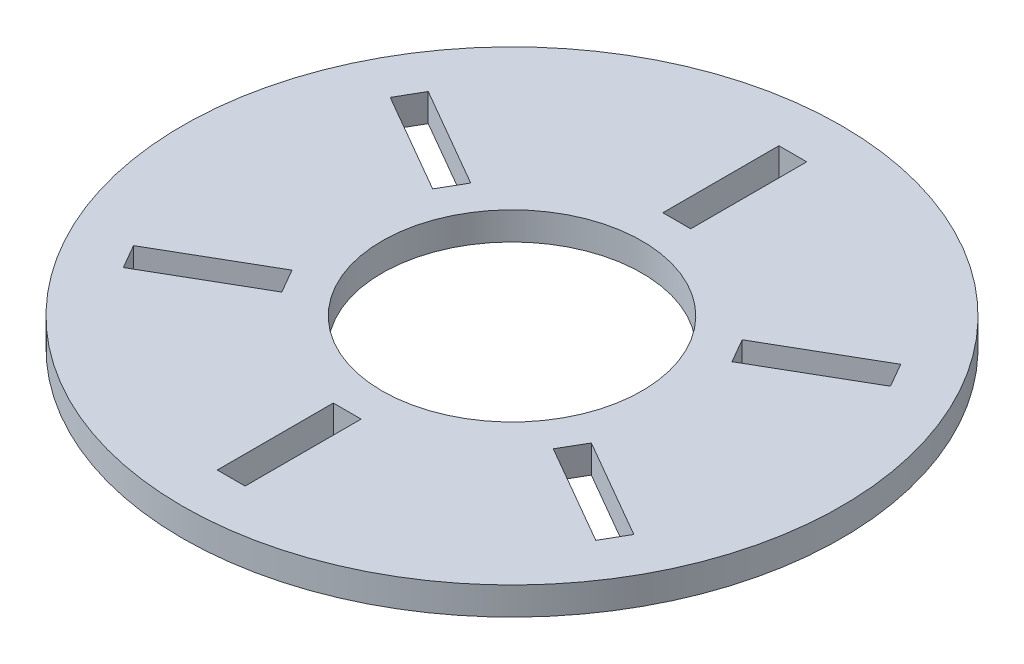
ISO-10303-21;
HEADER;
FILE_DESCRIPTION(('STEP AP214'),'2;1');
FILE_NAME('part.step','',(''),(''),'','','');
FILE_SCHEMA(('AUTOMOTIVE_DESIGN { 1 0 10303 214 1 1 1 1 }'));
ENDSEC;
DATA;
#1=APPLICATION_CONTEXT('core data for automotive mechanical design processes');
#2=APPLICATION_PROTOCOL_DEFINITION('international standard','automotive_design',2000,#1);
#3=PRODUCT_CONTEXT('',#1,'mechanical');
#4=PRODUCT('Part','Part','',(#3));
#5=PRODUCT_RELATED_PRODUCT_CATEGORY('part','',(#4));
#6=PRODUCT_DEFINITION_FORMATION('','',#4);
#7=PRODUCT_DEFINITION_CONTEXT('part definition',#1,'design');
#8=PRODUCT_DEFINITION('design','',#6,#7);
#9=PRODUCT_DEFINITION_SHAPE('','',#8);
#10=(LENGTH_UNIT() NAMED_UNIT(*) SI_UNIT(.MILLI.,.METRE.));
#11=(NAMED_UNIT(*) PLANE_ANGLE_UNIT() SI_UNIT($,.RADIAN.));
#12=(NAMED_UNIT(*) SI_UNIT($,.STERADIAN.) SOLID_ANGLE_UNIT());
#13=UNCERTAINTY_MEASURE_WITH_UNIT(LENGTH_MEASURE(1.E-05),#10,'distance_accuracy_value','');
#14=(GEOMETRIC_REPRESENTATION_CONTEXT(3) GLOBAL_UNCERTAINTY_ASSIGNED_CONTEXT((#13)) GLOBAL_UNIT_ASSIGNED_CONTEXT((#10,
#11,#12)) REPRESENTATION_CONTEXT('',''));
#15=CARTESIAN_POINT('',(0.,0.,0.));
#16=DIRECTION('',(0.,0.,1.));
#17=DIRECTION('',(1.,0.,0.));
#18=AXIS2_PLACEMENT_3D('',#15,#16,#17);
#19=CARTESIAN_POINT('',(0.,6.,0.));
#20=DIRECTION('',(0.,1.,0.));
#21=DIRECTION('',(0.,0.,1.));
#22=AXIS2_PLACEMENT_3D('',#19,#20,#21);
#23=PLANE('',#22);
#24=DIRECTION('',(0.499999999999999,0.,-0.866025403784439));
#25=VECTOR('',#24,1.);
#26=CARTESIAN_POINT('',(-30.7439018343476,6.,-17.75));
#27=LINE('',#26,#25);
#28=CARTESIAN_POINT('',(-32.2439018343476,6.,-15.1519237886467));
#29=VERTEX_POINT('',#28);
#30=CARTESIAN_POINT('',(-29.2439018343476,6.,-20.3480762113533));
#31=VERTEX_POINT('',#30);
#32=EDGE_CURVE('E229',#29,#31,#27,.T.);
#33=ORIENTED_EDGE('',*,*,#32,.F.);
#34=DIRECTION('',(0.866025403784439,0.,0.499999999999999));
#35=VECTOR('',#34,1.);
#36=CARTESIAN_POINT('',(-1.49999999999999,6.,2.5980762113533));
#37=LINE('',#36,#35);
#38=CARTESIAN_POINT('',(-53.8945369289586,6.,-27.6519237886466));
#39=VERTEX_POINT('',#38);
#40=EDGE_CURVE('E222',#39,#29,#37,.T.);
#41=ORIENTED_EDGE('',*,*,#40,.F.);
#42=DIRECTION('',(-0.499999999999999,0.,0.866025403784439));
#43=VECTOR('',#42,1.);
#44=CARTESIAN_POINT('',(-52.3945369289586,6.,-30.2499999999999));
#45=LINE('',#44,#43);
#46=CARTESIAN_POINT('',(-50.8945369289586,6.,-32.8480762113533));
#47=VERTEX_POINT('',#46);
#48=EDGE_CURVE('E202',#47,#39,#45,.T.);
#49=ORIENTED_EDGE('',*,*,#48,.F.);
#50=DIRECTION('',(-0.866025403784439,0.,-0.499999999999999));
#51=VECTOR('',#50,1.);
#52=CARTESIAN_POINT('',(1.50000000000001,6.,-2.59807621135334));
#53=LINE('',#52,#51);
#54=EDGE_CURVE('E227',#31,#47,#53,.T.);
#55=ORIENTED_EDGE('',*,*,#54,.F.);
#56=EDGE_LOOP('',(#33,#41,#49,#55));
#57=FACE_BOUND('',#56,.T.);
#58=DIRECTION('',(-0.500000000000001,0.,-0.866025403784438));
#59=VECTOR('',#58,1.);
#60=CARTESIAN_POINT('',(-30.7439018343476,6.,17.75));
#61=LINE('',#60,#59);
#62=CARTESIAN_POINT('',(-29.2439018343476,6.,20.3480762113533));
#63=VERTEX_POINT('',#62);
#64=CARTESIAN_POINT('',(-32.2439018343476,6.,15.1519237886467));
#65=VERTEX_POINT('',#64);
#66=EDGE_CURVE('E258',#63,#65,#61,.T.);
#67=ORIENTED_EDGE('',*,*,#66,.F.);
#68=DIRECTION('',(0.866025403784438,0.,-0.5));
#69=VECTOR('',#68,1.);
#70=CARTESIAN_POINT('',(1.5,6.,2.59807621135331));
#71=LINE('',#70,#69);
#72=CARTESIAN_POINT('',(-50.8945369289585,6.,32.8480762113533));
#73=VERTEX_POINT('',#72);
#74=EDGE_CURVE('E245',#73,#63,#71,.T.);
#75=ORIENTED_EDGE('',*,*,#74,.F.);
#76=DIRECTION('',(0.500000000000001,0.,0.866025403784438));
#77=VECTOR('',#76,1.);
#78=CARTESIAN_POINT('',(-52.3945369289585,6.,30.25));
#79=LINE('',#78,#77);
#80=CARTESIAN_POINT('',(-53.8945369289585,6.,27.6519237886467));
#81=VERTEX_POINT('',#80);
#82=EDGE_CURVE('E253',#81,#73,#79,.T.);
#83=ORIENTED_EDGE('',*,*,#82,.F.);
#84=DIRECTION('',(-0.866025403784438,0.,0.5));
#85=VECTOR('',#84,1.);
#86=CARTESIAN_POINT('',(-1.5,6.,-2.59807621135331));
#87=LINE('',#86,#85);
#88=EDGE_CURVE('E256',#65,#81,#87,.T.);
#89=ORIENTED_EDGE('',*,*,#88,.F.);
#90=EDGE_LOOP('',(#67,#75,#83,#89));
#91=FACE_BOUND('',#90,.T.);
#92=DIRECTION('',(-1.,0.,0.));
#93=VECTOR('',#92,1.);
#94=CARTESIAN_POINT('',(0.,6.,35.5));
#95=LINE('',#94,#93);
#96=CARTESIAN_POINT('',(3.,6.,35.5));
#97=VERTEX_POINT('',#96);
#98=CARTESIAN_POINT('',(-3.,6.,35.5));
#99=VERTEX_POINT('',#98);
#100=EDGE_CURVE('E287',#97,#99,#95,.T.);
#101=ORIENTED_EDGE('',*,*,#100,.F.);
#102=DIRECTION('',(0.,0.,-1.));
#103=VECTOR('',#102,1.);
#104=CARTESIAN_POINT('',(2.99999999999999,6.,0.));
#105=LINE('',#104,#103);
#106=CARTESIAN_POINT('',(3.,6.,60.5));
#107=VERTEX_POINT('',#106);
#108=EDGE_CURVE('E274',#107,#97,#105,.T.);
#109=ORIENTED_EDGE('',*,*,#108,.F.);
#110=DIRECTION('',(1.,0.,0.));
#111=VECTOR('',#110,1.);
#112=CARTESIAN_POINT('',(0.,6.,60.5));
#113=LINE('',#112,#111);
#114=CARTESIAN_POINT('',(-3.,6.,60.5));
#115=VERTEX_POINT('',#114);
#116=EDGE_CURVE('E282',#115,#107,#113,.T.);
#117=ORIENTED_EDGE('',*,*,#116,.F.);
#118=DIRECTION('',(0.,0.,1.));
#119=VECTOR('',#118,1.);
#120=CARTESIAN_POINT('',(-3.00000000000001,6.,0.));
#121=LINE('',#120,#119);
#122=EDGE_CURVE('E285',#99,#115,#121,.T.);
#123=ORIENTED_EDGE('',*,*,#122,.F.);
#124=EDGE_LOOP('',(#101,#109,#117,#123));
#125=FACE_BOUND('',#124,.T.);
#126=DIRECTION('',(-0.5,0.,0.866025403784438));
#127=VECTOR('',#126,1.);
#128=CARTESIAN_POINT('',(30.7439018343476,6.,17.75));
#129=LINE('',#128,#127);
#130=CARTESIAN_POINT('',(32.2439018343476,6.,15.1519237886467));
#131=VERTEX_POINT('',#130);
#132=CARTESIAN_POINT('',(29.2439018343476,6.,20.3480762113533));
#133=VERTEX_POINT('',#132);
#134=EDGE_CURVE('E316',#131,#133,#129,.T.);
#135=ORIENTED_EDGE('',*,*,#134,.F.);
#136=DIRECTION('',(-0.866025403784439,0.,-0.5));
#137=VECTOR('',#136,1.);
#138=CARTESIAN_POINT('',(1.5,6.,-2.59807621135331));
#139=LINE('',#138,#137);
#140=CARTESIAN_POINT('',(53.8945369289586,6.,27.6519237886467));
#141=VERTEX_POINT('',#140);
#142=EDGE_CURVE('E303',#141,#131,#139,.T.);
#143=ORIENTED_EDGE('',*,*,#142,.F.);
#144=DIRECTION('',(0.500000000000001,0.,-0.866025403784438));
#145=VECTOR('',#144,1.);
#146=CARTESIAN_POINT('',(52.3945369289585,6.,30.2500000000001));
#147=LINE('',#146,#145);
#148=CARTESIAN_POINT('',(50.8945369289585,6.,32.8480762113533));
#149=VERTEX_POINT('',#148);
#150=EDGE_CURVE('E311',#149,#141,#147,.T.);
#151=ORIENTED_EDGE('',*,*,#150,.F.);
#152=DIRECTION('',(0.866025403784439,0.,0.5));
#153=VECTOR('',#152,1.);
#154=CARTESIAN_POINT('',(-1.5,6.,2.59807621135332));
#155=LINE('',#154,#153);
#156=EDGE_CURVE('E314',#133,#149,#155,.T.);
#157=ORIENTED_EDGE('',*,*,#156,.F.);
#158=EDGE_LOOP('',(#135,#143,#151,#157));
#159=FACE_BOUND('',#158,.T.);
#160=DIRECTION('',(0.500000000000001,0.,0.866025403784438));
#161=VECTOR('',#160,1.);
#162=CARTESIAN_POINT('',(30.7439018343476,6.,-17.75));
#163=LINE('',#162,#161);
#164=CARTESIAN_POINT('',(29.2439018343476,6.,-20.3480762113533));
#165=VERTEX_POINT('',#164);
#166=CARTESIAN_POINT('',(32.2439018343476,6.,-15.1519237886467));
#167=VERTEX_POINT('',#166);
#168=EDGE_CURVE('E345',#165,#167,#163,.T.);
#169=ORIENTED_EDGE('',*,*,#168,.F.);
#170=DIRECTION('',(-0.866025403784439,0.,0.5));
#171=VECTOR('',#170,1.);
#172=CARTESIAN_POINT('',(-1.5,6.,-2.59807621135331));
#173=LINE('',#172,#171);
#174=CARTESIAN_POINT('',(50.8945369289585,6.,-32.8480762113533));
#175=VERTEX_POINT('',#174);
#176=EDGE_CURVE('E332',#175,#165,#173,.T.);
#177=ORIENTED_EDGE('',*,*,#176,.F.);
#178=DIRECTION('',(-0.500000000000001,0.,-0.866025403784438));
#179=VECTOR('',#178,1.);
#180=CARTESIAN_POINT('',(52.3945369289585,6.,-30.2500000000001));
#181=LINE('',#180,#179);
#182=CARTESIAN_POINT('',(53.8945369289585,6.,-27.6519237886467));
#183=VERTEX_POINT('',#182);
#184=EDGE_CURVE('E340',#183,#175,#181,.T.);
#185=ORIENTED_EDGE('',*,*,#184,.F.);
#186=DIRECTION('',(0.866025403784439,0.,-0.5));
#187=VECTOR('',#186,1.);
#188=CARTESIAN_POINT('',(1.50000000000001,6.,2.59807621135333));
#189=LINE('',#188,#187);
#190=EDGE_CURVE('E343',#167,#183,#189,.T.);
#191=ORIENTED_EDGE('',*,*,#190,.F.);
#192=EDGE_LOOP('',(#169,#177,#185,#191));
#193=FACE_BOUND('',#192,.T.);
#194=DIRECTION('',(0.,0.,1.));
#195=VECTOR('',#194,1.);
#196=CARTESIAN_POINT('',(-2.99999999999999,6.,0.));
#197=LINE('',#196,#195);
#198=CARTESIAN_POINT('',(-2.99999999999999,6.,-60.5));
#199=VERTEX_POINT('',#198);
#200=CARTESIAN_POINT('',(-2.99999999999999,6.,-35.5));
#201=VERTEX_POINT('',#200);
#202=EDGE_CURVE('E374',#199,#201,#197,.T.);
#203=ORIENTED_EDGE('',*,*,#202,.F.);
#204=DIRECTION('',(-1.,0.,0.));
#205=VECTOR('',#204,1.);
#206=CARTESIAN_POINT('',(0.,6.,-60.5));
#207=LINE('',#206,#205);
#208=CARTESIAN_POINT('',(3.00000000000001,6.,-60.5));
#209=VERTEX_POINT('',#208);
#210=EDGE_CURVE('E361',#209,#199,#207,.T.);
#211=ORIENTED_EDGE('',*,*,#210,.F.);
#212=DIRECTION('',(0.,0.,-1.));
#213=VECTOR('',#212,1.);
#214=CARTESIAN_POINT('',(3.00000000000001,6.,0.));
#215=LINE('',#214,#213);
#216=CARTESIAN_POINT('',(3.00000000000001,6.,-35.5));
#217=VERTEX_POINT('',#216);
#218=EDGE_CURVE('E369',#217,#209,#215,.T.);
#219=ORIENTED_EDGE('',*,*,#218,.F.);
#220=DIRECTION('',(1.,0.,0.));
#221=VECTOR('',#220,1.);
#222=CARTESIAN_POINT('',(0.,6.,-35.5));
#223=LINE('',#222,#221);
#224=EDGE_CURVE('E372',#201,#217,#223,.T.);
#225=ORIENTED_EDGE('',*,*,#224,.F.);
#226=EDGE_LOOP('',(#203,#211,#219,#225));
#227=FACE_BOUND('',#226,.T.);
#228=CARTESIAN_POINT('',(0.,6.,0.));
#229=DIRECTION('',(0.,1.,0.));
#230=DIRECTION('',(0.,0.,1.));
#231=AXIS2_PLACEMENT_3D('',#228,#229,#230);
#232=CIRCLE('',#231,71.);
#233=CARTESIAN_POINT('',(0.,6.,71.));
#234=VERTEX_POINT('',#233);
#235=EDGE_CURVE('E11',#234,#234,#232,.T.);
#236=ORIENTED_EDGE('',*,*,#235,.T.);
#237=EDGE_LOOP('',(#236));
#238=FACE_BOUND('',#237,.T.);
#239=CARTESIAN_POINT('',(0.,6.,0.));
#240=DIRECTION('',(0.,1.,0.));
#241=DIRECTION('',(0.,0.,1.));
#242=AXIS2_PLACEMENT_3D('',#239,#240,#241);
#243=CIRCLE('',#242,28.);
#244=CARTESIAN_POINT('',(0.,6.,28.));
#245=VERTEX_POINT('',#244);
#246=EDGE_CURVE('E377',#245,#245,#243,.T.);
#247=ORIENTED_EDGE('',*,*,#246,.F.);
#248=EDGE_LOOP('',(#247));
#249=FACE_BOUND('',#248,.T.);
#250=ADVANCED_FACE('F35',(#57,#91,#125,#159,#193,#227,#238,#249),#23,.T.);
#251=CARTESIAN_POINT('',(0.,0.,0.));
#252=DIRECTION('',(0.,1.,0.));
#253=DIRECTION('',(0.,0.,1.));
#254=AXIS2_PLACEMENT_3D('',#251,#252,#253);
#255=PLANE('',#254);
#256=DIRECTION('',(-0.866025403784439,0.,-0.499999999999999));
#257=VECTOR('',#256,1.);
#258=CARTESIAN_POINT('',(-53.8945369289586,0.,-27.6519237886466));
#259=LINE('',#258,#257);
#260=CARTESIAN_POINT('',(-32.2439018343476,0.,-15.1519237886467));
#261=VERTEX_POINT('',#260);
#262=CARTESIAN_POINT('',(-53.8945369289586,0.,-27.6519237886466));
#263=VERTEX_POINT('',#262);
#264=EDGE_CURVE('E208',#261,#263,#259,.T.);
#265=ORIENTED_EDGE('',*,*,#264,.F.);
#266=DIRECTION('',(-0.499999999999999,0.,0.866025403784439));
#267=VECTOR('',#266,1.);
#268=CARTESIAN_POINT('',(-29.2439018343476,0.,-20.3480762113533));
#269=LINE('',#268,#267);
#270=CARTESIAN_POINT('',(-29.2439018343476,0.,-20.3480762113533));
#271=VERTEX_POINT('',#270);
#272=EDGE_CURVE('E58',#271,#261,#269,.T.);
#273=ORIENTED_EDGE('',*,*,#272,.F.);
#274=DIRECTION('',(0.866025403784439,0.,0.499999999999999));
#275=VECTOR('',#274,1.);
#276=CARTESIAN_POINT('',(-50.8945369289586,0.,-32.8480762113533));
#277=LINE('',#276,#275);
#278=CARTESIAN_POINT('',(-50.8945369289586,0.,-32.8480762113533));
#279=VERTEX_POINT('',#278);
#280=EDGE_CURVE('E215',#279,#271,#277,.T.);
#281=ORIENTED_EDGE('',*,*,#280,.F.);
#282=DIRECTION('',(0.499999999999999,0.,-0.866025403784439));
#283=VECTOR('',#282,1.);
#284=CARTESIAN_POINT('',(-50.8945369289586,0.,-32.8480762113533));
#285=LINE('',#284,#283);
#286=EDGE_CURVE('E199',#263,#279,#285,.T.);
#287=ORIENTED_EDGE('',*,*,#286,.F.);
#288=EDGE_LOOP('',(#265,#273,#281,#287));
#289=FACE_BOUND('',#288,.T.);
#290=DIRECTION('',(-0.866025403784438,0.,0.5));
#291=VECTOR('',#290,1.);
#292=CARTESIAN_POINT('',(-50.8945369289585,0.,32.8480762113533));
#293=LINE('',#292,#291);
#294=CARTESIAN_POINT('',(-29.2439018343476,0.,20.3480762113533));
#295=VERTEX_POINT('',#294);
#296=CARTESIAN_POINT('',(-50.8945369289585,0.,32.8480762113533));
#297=VERTEX_POINT('',#296);
#298=EDGE_CURVE('E233',#295,#297,#293,.T.);
#299=ORIENTED_EDGE('',*,*,#298,.F.);
#300=DIRECTION('',(0.500000000000001,0.,0.866025403784438));
#301=VECTOR('',#300,1.);
#302=CARTESIAN_POINT('',(-32.2439018343476,0.,15.1519237886467));
#303=LINE('',#302,#301);
#304=CARTESIAN_POINT('',(-32.2439018343476,0.,15.1519237886467));
#305=VERTEX_POINT('',#304);
#306=EDGE_CURVE('E231',#305,#295,#303,.T.);
#307=ORIENTED_EDGE('',*,*,#306,.F.);
#308=DIRECTION('',(0.866025403784438,0.,-0.5));
#309=VECTOR('',#308,1.);
#310=CARTESIAN_POINT('',(-53.8945369289585,0.,27.6519237886467));
#311=LINE('',#310,#309);
#312=CARTESIAN_POINT('',(-53.8945369289585,0.,27.6519237886467));
#313=VERTEX_POINT('',#312);
#314=EDGE_CURVE('E239',#313,#305,#311,.T.);
#315=ORIENTED_EDGE('',*,*,#314,.F.);
#316=DIRECTION('',(-0.500000000000001,0.,-0.866025403784438));
#317=VECTOR('',#316,1.);
#318=CARTESIAN_POINT('',(-53.8945369289585,0.,27.6519237886467));
#319=LINE('',#318,#317);
#320=EDGE_CURVE('E236',#297,#313,#319,.T.);
#321=ORIENTED_EDGE('',*,*,#320,.F.);
#322=EDGE_LOOP('',(#299,#307,#315,#321));
#323=FACE_BOUND('',#322,.T.);
#324=DIRECTION('',(0.,0.,1.));
#325=VECTOR('',#324,1.);
#326=CARTESIAN_POINT('',(3.,0.,60.5));
#327=LINE('',#326,#325);
#328=CARTESIAN_POINT('',(3.,0.,35.5));
#329=VERTEX_POINT('',#328);
#330=CARTESIAN_POINT('',(3.,0.,60.5));
#331=VERTEX_POINT('',#330);
#332=EDGE_CURVE('E262',#329,#331,#327,.T.);
#333=ORIENTED_EDGE('',*,*,#332,.F.);
#334=DIRECTION('',(1.,0.,0.));
#335=VECTOR('',#334,1.);
#336=CARTESIAN_POINT('',(-3.,0.,35.5));
#337=LINE('',#336,#335);
#338=CARTESIAN_POINT('',(-3.,0.,35.5));
#339=VERTEX_POINT('',#338);
#340=EDGE_CURVE('E260',#339,#329,#337,.T.);
#341=ORIENTED_EDGE('',*,*,#340,.F.);
#342=DIRECTION('',(0.,0.,-1.));
#343=VECTOR('',#342,1.);
#344=CARTESIAN_POINT('',(-3.,0.,60.5));
#345=LINE('',#344,#343);
#346=CARTESIAN_POINT('',(-3.,0.,60.5));
#347=VERTEX_POINT('',#346);
#348=EDGE_CURVE('E268',#347,#339,#345,.T.);
#349=ORIENTED_EDGE('',*,*,#348,.F.);
#350=DIRECTION('',(-1.,0.,0.));
#351=VECTOR('',#350,1.);
#352=CARTESIAN_POINT('',(-3.,0.,60.5));
#353=LINE('',#352,#351);
#354=EDGE_CURVE('E265',#331,#347,#353,.T.);
#355=ORIENTED_EDGE('',*,*,#354,.F.);
#356=EDGE_LOOP('',(#333,#341,#349,#355));
#357=FACE_BOUND('',#356,.T.);
#358=DIRECTION('',(0.866025403784439,0.,0.5));
#359=VECTOR('',#358,1.);
#360=CARTESIAN_POINT('',(53.8945369289586,0.,27.6519237886467));
#361=LINE('',#360,#359);
#362=CARTESIAN_POINT('',(32.2439018343476,0.,15.1519237886467));
#363=VERTEX_POINT('',#362);
#364=CARTESIAN_POINT('',(53.8945369289586,0.,27.6519237886467));
#365=VERTEX_POINT('',#364);
#366=EDGE_CURVE('E291',#363,#365,#361,.T.);
#367=ORIENTED_EDGE('',*,*,#366,.F.);
#368=DIRECTION('',(0.5,0.,-0.866025403784439));
#369=VECTOR('',#368,1.);
#370=CARTESIAN_POINT('',(29.2439018343476,0.,20.3480762113533));
#371=LINE('',#370,#369);
#372=CARTESIAN_POINT('',(29.2439018343476,0.,20.3480762113533));
#373=VERTEX_POINT('',#372);
#374=EDGE_CURVE('E289',#373,#363,#371,.T.);
#375=ORIENTED_EDGE('',*,*,#374,.F.);
#376=DIRECTION('',(-0.866025403784439,0.,-0.5));
#377=VECTOR('',#376,1.);
#378=CARTESIAN_POINT('',(50.8945369289585,0.,32.8480762113533));
#379=LINE('',#378,#377);
#380=CARTESIAN_POINT('',(50.8945369289585,0.,32.8480762113533));
#381=VERTEX_POINT('',#380);
#382=EDGE_CURVE('E297',#381,#373,#379,.T.);
#383=ORIENTED_EDGE('',*,*,#382,.F.);
#384=DIRECTION('',(-0.500000000000001,0.,0.866025403784438));
#385=VECTOR('',#384,1.);
#386=CARTESIAN_POINT('',(50.8945369289585,0.,32.8480762113533));
#387=LINE('',#386,#385);
#388=EDGE_CURVE('E294',#365,#381,#387,.T.);
#389=ORIENTED_EDGE('',*,*,#388,.F.);
#390=EDGE_LOOP('',(#367,#375,#383,#389));
#391=FACE_BOUND('',#390,.T.);
#392=DIRECTION('',(0.866025403784438,0.,-0.5));
#393=VECTOR('',#392,1.);
#394=CARTESIAN_POINT('',(50.8945369289585,0.,-32.8480762113533));
#395=LINE('',#394,#393);
#396=CARTESIAN_POINT('',(29.2439018343476,0.,-20.3480762113533));
#397=VERTEX_POINT('',#396);
#398=CARTESIAN_POINT('',(50.8945369289585,0.,-32.8480762113533));
#399=VERTEX_POINT('',#398);
#400=EDGE_CURVE('E320',#397,#399,#395,.T.);
#401=ORIENTED_EDGE('',*,*,#400,.F.);
#402=DIRECTION('',(-0.500000000000001,0.,-0.866025403784438));
#403=VECTOR('',#402,1.);
#404=CARTESIAN_POINT('',(32.2439018343476,0.,-15.1519237886467));
#405=LINE('',#404,#403);
#406=CARTESIAN_POINT('',(32.2439018343476,0.,-15.1519237886467));
#407=VERTEX_POINT('',#406);
#408=EDGE_CURVE('E318',#407,#397,#405,.T.);
#409=ORIENTED_EDGE('',*,*,#408,.F.);
#410=DIRECTION('',(-0.866025403784439,0.,0.5));
#411=VECTOR('',#410,1.);
#412=CARTESIAN_POINT('',(53.8945369289585,0.,-27.6519237886467));
#413=LINE('',#412,#411);
#414=CARTESIAN_POINT('',(53.8945369289585,0.,-27.6519237886467));
#415=VERTEX_POINT('',#414);
#416=EDGE_CURVE('E326',#415,#407,#413,.T.);
#417=ORIENTED_EDGE('',*,*,#416,.F.);
#418=DIRECTION('',(0.500000000000001,0.,0.866025403784438));
#419=VECTOR('',#418,1.);
#420=CARTESIAN_POINT('',(53.8945369289585,0.,-27.6519237886467));
#421=LINE('',#420,#419);
#422=EDGE_CURVE('E323',#399,#415,#421,.T.);
#423=ORIENTED_EDGE('',*,*,#422,.F.);
#424=EDGE_LOOP('',(#401,#409,#417,#423));
#425=FACE_BOUND('',#424,.T.);
#426=DIRECTION('',(1.,0.,0.));
#427=VECTOR('',#426,1.);
#428=CARTESIAN_POINT('',(3.00000000000001,0.,-60.5));
#429=LINE('',#428,#427);
#430=CARTESIAN_POINT('',(-2.99999999999999,0.,-60.5));
#431=VERTEX_POINT('',#430);
#432=CARTESIAN_POINT('',(3.00000000000001,0.,-60.5));
#433=VERTEX_POINT('',#432);
#434=EDGE_CURVE('E349',#431,#433,#429,.T.);
#435=ORIENTED_EDGE('',*,*,#434,.F.);
#436=DIRECTION('',(0.,0.,-1.));
#437=VECTOR('',#436,1.);
#438=CARTESIAN_POINT('',(-2.99999999999999,0.,-60.5));
#439=LINE('',#438,#437);
#440=CARTESIAN_POINT('',(-2.99999999999999,0.,-35.5));
#441=VERTEX_POINT('',#440);
#442=EDGE_CURVE('E347',#441,#431,#439,.T.);
#443=ORIENTED_EDGE('',*,*,#442,.F.);
#444=DIRECTION('',(-1.,0.,0.));
#445=VECTOR('',#444,1.);
#446=CARTESIAN_POINT('',(3.00000000000001,0.,-35.5));
#447=LINE('',#446,#445);
#448=CARTESIAN_POINT('',(3.00000000000001,0.,-35.5));
#449=VERTEX_POINT('',#448);
#450=EDGE_CURVE('E355',#449,#441,#447,.T.);
#451=ORIENTED_EDGE('',*,*,#450,.F.);
#452=DIRECTION('',(0.,0.,1.));
#453=VECTOR('',#452,1.);
#454=CARTESIAN_POINT('',(3.00000000000001,0.,-60.5));
#455=LINE('',#454,#453);
#456=EDGE_CURVE('E352',#433,#449,#455,.T.);
#457=ORIENTED_EDGE('',*,*,#456,.F.);
#458=EDGE_LOOP('',(#435,#443,#451,#457));
#459=FACE_BOUND('',#458,.T.);
#460=CARTESIAN_POINT('',(0.,0.,0.));
#461=DIRECTION('',(0.,1.,0.));
#462=DIRECTION('',(0.,0.,1.));
#463=AXIS2_PLACEMENT_3D('',#460,#461,#462);
#464=CIRCLE('',#463,71.);
#465=CARTESIAN_POINT('',(0.,0.,71.));
#466=VERTEX_POINT('',#465);
#467=EDGE_CURVE('E39',#466,#466,#464,.T.);
#468=ORIENTED_EDGE('',*,*,#467,.F.);
#469=EDGE_LOOP('',(#468));
#470=FACE_BOUND('',#469,.T.);
#471=CARTESIAN_POINT('',(0.,0.,0.));
#472=DIRECTION('',(0.,1.,0.));
#473=DIRECTION('',(0.,0.,1.));
#474=AXIS2_PLACEMENT_3D('',#471,#472,#473);
#475=CIRCLE('',#474,28.);
#476=CARTESIAN_POINT('',(0.,0.,28.));
#477=VERTEX_POINT('',#476);
#478=EDGE_CURVE('E376',#477,#477,#475,.T.);
#479=ORIENTED_EDGE('',*,*,#478,.T.);
#480=EDGE_LOOP('',(#479));
#481=FACE_BOUND('',#480,.T.);
#482=ADVANCED_FACE('F212',(#289,#323,#357,#391,#425,#459,#470,#481),#255,.F.);
#483=CARTESIAN_POINT('',(0.,6.,0.));
#484=DIRECTION('',(0.,-1.,0.));
#485=DIRECTION('',(0.,0.,-1.));
#486=AXIS2_PLACEMENT_3D('',#483,#484,#485);
#487=CYLINDRICAL_SURFACE('',#486,71.);
#488=ORIENTED_EDGE('',*,*,#235,.F.);
#489=EDGE_LOOP('',(#488));
#490=FACE_BOUND('',#489,.T.);
#491=ORIENTED_EDGE('',*,*,#467,.T.);
#492=EDGE_LOOP('',(#491));
#493=FACE_BOUND('',#492,.T.);
#494=ADVANCED_FACE('F37',(#490,#493),#487,.T.);
#495=CARTESIAN_POINT('',(0.,6.,0.));
#496=DIRECTION('',(0.,-1.,0.));
#497=DIRECTION('',(0.,0.,-1.));
#498=AXIS2_PLACEMENT_3D('',#495,#496,#497);
#499=CYLINDRICAL_SURFACE('',#498,28.);
#500=ORIENTED_EDGE('',*,*,#246,.T.);
#501=EDGE_LOOP('',(#500));
#502=FACE_BOUND('',#501,.T.);
#503=ORIENTED_EDGE('',*,*,#478,.F.);
#504=EDGE_LOOP('',(#503));
#505=FACE_BOUND('',#504,.T.);
#506=ADVANCED_FACE('F384',(#502,#505),#499,.F.);
#507=CARTESIAN_POINT('',(-2.99999999999999,10.,-60.5));
#508=DIRECTION('',(-1.,0.,0.));
#509=DIRECTION('',(0.,0.,1.));
#510=AXIS2_PLACEMENT_3D('',#507,#508,#509);
#511=PLANE('',#510);
#512=ORIENTED_EDGE('',*,*,#202,.T.);
#513=DIRECTION('',(0.,-1.,0.));
#514=VECTOR('',#513,1.);
#515=CARTESIAN_POINT('',(-2.99999999999999,10.,-35.5));
#516=LINE('',#515,#514);
#517=EDGE_CURVE('E359',#201,#441,#516,.T.);
#518=ORIENTED_EDGE('',*,*,#517,.T.);
#519=ORIENTED_EDGE('',*,*,#442,.T.);
#520=DIRECTION('',(0.,-1.,0.));
#521=VECTOR('',#520,1.);
#522=CARTESIAN_POINT('',(-2.99999999999999,10.,-60.5));
#523=LINE('',#522,#521);
#524=EDGE_CURVE('E358',#199,#431,#523,.T.);
#525=ORIENTED_EDGE('',*,*,#524,.F.);
#526=EDGE_LOOP('',(#512,#518,#519,#525));
#527=FACE_BOUND('',#526,.T.);
#528=ADVANCED_FACE('F386',(#527),#511,.F.);
#529=CARTESIAN_POINT('',(3.00000000000001,10.,-35.5));
#530=DIRECTION('',(0.,0.,1.));
#531=DIRECTION('',(1.,0.,0.));
#532=AXIS2_PLACEMENT_3D('',#529,#530,#531);
#533=PLANE('',#532);
#534=ORIENTED_EDGE('',*,*,#224,.T.);
#535=DIRECTION('',(0.,-1.,0.));
#536=VECTOR('',#535,1.);
#537=CARTESIAN_POINT('',(3.00000000000001,10.,-35.5));
#538=LINE('',#537,#536);
#539=EDGE_CURVE('E362',#217,#449,#538,.T.);
#540=ORIENTED_EDGE('',*,*,#539,.T.);
#541=ORIENTED_EDGE('',*,*,#450,.T.);
#542=ORIENTED_EDGE('',*,*,#517,.F.);
#543=EDGE_LOOP('',(#534,#540,#541,#542));
#544=FACE_BOUND('',#543,.T.);
#545=ADVANCED_FACE('F393',(#544),#533,.F.);
#546=CARTESIAN_POINT('',(3.00000000000001,10.,-60.5));
#547=DIRECTION('',(1.,0.,0.));
#548=DIRECTION('',(0.,0.,-1.));
#549=AXIS2_PLACEMENT_3D('',#546,#547,#548);
#550=PLANE('',#549);
#551=ORIENTED_EDGE('',*,*,#218,.T.);
#552=DIRECTION('',(0.,-1.,0.));
#553=VECTOR('',#552,1.);
#554=CARTESIAN_POINT('',(3.00000000000001,10.,-60.5));
#555=LINE('',#554,#553);
#556=EDGE_CURVE('E364',#209,#433,#555,.T.);
#557=ORIENTED_EDGE('',*,*,#556,.T.);
#558=ORIENTED_EDGE('',*,*,#456,.T.);
#559=ORIENTED_EDGE('',*,*,#539,.F.);
#560=EDGE_LOOP('',(#551,#557,#558,#559));
#561=FACE_BOUND('',#560,.T.);
#562=ADVANCED_FACE('F446',(#561),#550,.F.);
#563=CARTESIAN_POINT('',(3.00000000000001,10.,-60.5));
#564=DIRECTION('',(0.,0.,-1.));
#565=DIRECTION('',(-1.,0.,0.));
#566=AXIS2_PLACEMENT_3D('',#563,#564,#565);
#567=PLANE('',#566);
#568=ORIENTED_EDGE('',*,*,#210,.T.);
#569=ORIENTED_EDGE('',*,*,#524,.T.);
#570=ORIENTED_EDGE('',*,*,#434,.T.);
#571=ORIENTED_EDGE('',*,*,#556,.F.);
#572=EDGE_LOOP('',(#568,#569,#570,#571));
#573=FACE_BOUND('',#572,.T.);
#574=ADVANCED_FACE('F444',(#573),#567,.F.);
#575=CARTESIAN_POINT('',(32.2439018343476,10.,-15.1519237886467));
#576=DIRECTION('',(-0.866025403784438,0.,0.500000000000001));
#577=DIRECTION('',(0.500000000000001,0.,0.866025403784438));
#578=AXIS2_PLACEMENT_3D('',#575,#576,#577);
#579=PLANE('',#578);
#580=ORIENTED_EDGE('',*,*,#168,.T.);
#581=DIRECTION('',(0.,-1.,0.));
#582=VECTOR('',#581,1.);
#583=CARTESIAN_POINT('',(32.2439018343476,10.,-15.1519237886467));
#584=LINE('',#583,#582);
#585=EDGE_CURVE('E330',#167,#407,#584,.T.);
#586=ORIENTED_EDGE('',*,*,#585,.T.);
#587=ORIENTED_EDGE('',*,*,#408,.T.);
#588=DIRECTION('',(0.,-1.,0.));
#589=VECTOR('',#588,1.);
#590=CARTESIAN_POINT('',(29.2439018343476,10.,-20.3480762113533));
#591=LINE('',#590,#589);
#592=EDGE_CURVE('E329',#165,#397,#591,.T.);
#593=ORIENTED_EDGE('',*,*,#592,.F.);
#594=EDGE_LOOP('',(#580,#586,#587,#593));
#595=FACE_BOUND('',#594,.T.);
#596=ADVANCED_FACE('F453',(#595),#579,.F.);
#597=CARTESIAN_POINT('',(53.8945369289585,10.,-27.6519237886467));
#598=DIRECTION('',(0.5,0.,0.866025403784438));
#599=DIRECTION('',(0.866025403784439,0.,-0.5));
#600=AXIS2_PLACEMENT_3D('',#597,#598,#599);
#601=PLANE('',#600);
#602=ORIENTED_EDGE('',*,*,#190,.T.);
#603=DIRECTION('',(0.,-1.,0.));
#604=VECTOR('',#603,1.);
#605=CARTESIAN_POINT('',(53.8945369289585,10.,-27.6519237886467));
#606=LINE('',#605,#604);
#607=EDGE_CURVE('E333',#183,#415,#606,.T.);
#608=ORIENTED_EDGE('',*,*,#607,.T.);
#609=ORIENTED_EDGE('',*,*,#416,.T.);
#610=ORIENTED_EDGE('',*,*,#585,.F.);
#611=EDGE_LOOP('',(#602,#608,#609,#610));
#612=FACE_BOUND('',#611,.T.);
#613=ADVANCED_FACE('F459',(#612),#601,.F.);
#614=CARTESIAN_POINT('',(53.8945369289585,10.,-27.6519237886467));
#615=DIRECTION('',(0.866025403784438,0.,-0.500000000000001));
#616=DIRECTION('',(-0.500000000000001,0.,-0.866025403784438));
#617=AXIS2_PLACEMENT_3D('',#614,#615,#616);
#618=PLANE('',#617);
#619=ORIENTED_EDGE('',*,*,#184,.T.);
#620=DIRECTION('',(0.,-1.,0.));
#621=VECTOR('',#620,1.);
#622=CARTESIAN_POINT('',(50.8945369289585,10.,-32.8480762113533));
#623=LINE('',#622,#621);
#624=EDGE_CURVE('E335',#175,#399,#623,.T.);
#625=ORIENTED_EDGE('',*,*,#624,.T.);
#626=ORIENTED_EDGE('',*,*,#422,.T.);
#627=ORIENTED_EDGE('',*,*,#607,.F.);
#628=EDGE_LOOP('',(#619,#625,#626,#627));
#629=FACE_BOUND('',#628,.T.);
#630=ADVANCED_FACE('F465',(#629),#618,.F.);
#631=CARTESIAN_POINT('',(50.8945369289585,10.,-32.8480762113533));
#632=DIRECTION('',(-0.5,0.,-0.866025403784439));
#633=DIRECTION('',(-0.866025403784439,0.,0.5));
#634=AXIS2_PLACEMENT_3D('',#631,#632,#633);
#635=PLANE('',#634);
#636=ORIENTED_EDGE('',*,*,#176,.T.);
#637=ORIENTED_EDGE('',*,*,#592,.T.);
#638=ORIENTED_EDGE('',*,*,#400,.T.);
#639=ORIENTED_EDGE('',*,*,#624,.F.);
#640=EDGE_LOOP('',(#636,#637,#638,#639));
#641=FACE_BOUND('',#640,.T.);
#642=ADVANCED_FACE('F461',(#641),#635,.F.);
#643=CARTESIAN_POINT('',(29.2439018343476,10.,20.3480762113533));
#644=DIRECTION('',(-0.866025403784438,0.,-0.5));
#645=DIRECTION('',(-0.5,0.,0.866025403784438));
#646=AXIS2_PLACEMENT_3D('',#643,#644,#645);
#647=PLANE('',#646);
#648=ORIENTED_EDGE('',*,*,#134,.T.);
#649=DIRECTION('',(0.,-1.,0.));
#650=VECTOR('',#649,1.);
#651=CARTESIAN_POINT('',(29.2439018343476,10.,20.3480762113533));
#652=LINE('',#651,#650);
#653=EDGE_CURVE('E301',#133,#373,#652,.T.);
#654=ORIENTED_EDGE('',*,*,#653,.T.);
#655=ORIENTED_EDGE('',*,*,#374,.T.);
#656=DIRECTION('',(0.,-1.,0.));
#657=VECTOR('',#656,1.);
#658=CARTESIAN_POINT('',(32.2439018343476,10.,15.1519237886467));
#659=LINE('',#658,#657);
#660=EDGE_CURVE('E300',#131,#363,#659,.T.);
#661=ORIENTED_EDGE('',*,*,#660,.F.);
#662=EDGE_LOOP('',(#648,#654,#655,#661));
#663=FACE_BOUND('',#662,.T.);
#664=ADVANCED_FACE('F464',(#663),#647,.F.);
#665=CARTESIAN_POINT('',(50.8945369289585,10.,32.8480762113533));
#666=DIRECTION('',(-0.5,0.,0.866025403784439));
#667=DIRECTION('',(0.866025403784439,0.,0.5));
#668=AXIS2_PLACEMENT_3D('',#665,#666,#667);
#669=PLANE('',#668);
#670=ORIENTED_EDGE('',*,*,#156,.T.);
#671=DIRECTION('',(0.,-1.,0.));
#672=VECTOR('',#671,1.);
#673=CARTESIAN_POINT('',(50.8945369289585,10.,32.8480762113533));
#674=LINE('',#673,#672);
#675=EDGE_CURVE('E304',#149,#381,#674,.T.);
#676=ORIENTED_EDGE('',*,*,#675,.T.);
#677=ORIENTED_EDGE('',*,*,#382,.T.);
#678=ORIENTED_EDGE('',*,*,#653,.F.);
#679=EDGE_LOOP('',(#670,#676,#677,#678));
#680=FACE_BOUND('',#679,.T.);
#681=ADVANCED_FACE('F475',(#680),#669,.F.);
#682=CARTESIAN_POINT('',(50.8945369289585,10.,32.8480762113533));
#683=DIRECTION('',(0.866025403784438,0.,0.500000000000001));
#684=DIRECTION('',(0.500000000000001,0.,-0.866025403784438));
#685=AXIS2_PLACEMENT_3D('',#682,#683,#684);
#686=PLANE('',#685);
#687=ORIENTED_EDGE('',*,*,#150,.T.);
#688=DIRECTION('',(0.,-1.,0.));
#689=VECTOR('',#688,1.);
#690=CARTESIAN_POINT('',(53.8945369289586,10.,27.6519237886467));
#691=LINE('',#690,#689);
#692=EDGE_CURVE('E306',#141,#365,#691,.T.);
#693=ORIENTED_EDGE('',*,*,#692,.T.);
#694=ORIENTED_EDGE('',*,*,#388,.T.);
#695=ORIENTED_EDGE('',*,*,#675,.F.);
#696=EDGE_LOOP('',(#687,#693,#694,#695));
#697=FACE_BOUND('',#696,.T.);
#698=ADVANCED_FACE('F481',(#697),#686,.F.);
#699=CARTESIAN_POINT('',(53.8945369289586,10.,27.6519237886467));
#700=DIRECTION('',(0.5,0.,-0.866025403784439));
#701=DIRECTION('',(-0.866025403784439,0.,-0.5));
#702=AXIS2_PLACEMENT_3D('',#699,#700,#701);
#703=PLANE('',#702);
#704=ORIENTED_EDGE('',*,*,#142,.T.);
#705=ORIENTED_EDGE('',*,*,#660,.T.);
#706=ORIENTED_EDGE('',*,*,#366,.T.);
#707=ORIENTED_EDGE('',*,*,#692,.F.);
#708=EDGE_LOOP('',(#704,#705,#706,#707));
#709=FACE_BOUND('',#708,.T.);
#710=ADVANCED_FACE('F477',(#709),#703,.F.);
#711=CARTESIAN_POINT('',(-3.,10.,35.5));
#712=DIRECTION('',(0.,0.,-1.));
#713=DIRECTION('',(-1.,0.,0.));
#714=AXIS2_PLACEMENT_3D('',#711,#712,#713);
#715=PLANE('',#714);
#716=ORIENTED_EDGE('',*,*,#100,.T.);
#717=DIRECTION('',(0.,-1.,0.));
#718=VECTOR('',#717,1.);
#719=CARTESIAN_POINT('',(-3.,10.,35.5));
#720=LINE('',#719,#718);
#721=EDGE_CURVE('E272',#99,#339,#720,.T.);
#722=ORIENTED_EDGE('',*,*,#721,.T.);
#723=ORIENTED_EDGE('',*,*,#340,.T.);
#724=DIRECTION('',(0.,-1.,0.));
#725=VECTOR('',#724,1.);
#726=CARTESIAN_POINT('',(3.,10.,35.5));
#727=LINE('',#726,#725);
#728=EDGE_CURVE('E271',#97,#329,#727,.T.);
#729=ORIENTED_EDGE('',*,*,#728,.F.);
#730=EDGE_LOOP('',(#716,#722,#723,#729));
#731=FACE_BOUND('',#730,.T.);
#732=ADVANCED_FACE('F480',(#731),#715,.F.);
#733=CARTESIAN_POINT('',(-3.,10.,60.5));
#734=DIRECTION('',(-1.,0.,0.));
#735=DIRECTION('',(0.,0.,1.));
#736=AXIS2_PLACEMENT_3D('',#733,#734,#735);
#737=PLANE('',#736);
#738=ORIENTED_EDGE('',*,*,#122,.T.);
#739=DIRECTION('',(0.,-1.,0.));
#740=VECTOR('',#739,1.);
#741=CARTESIAN_POINT('',(-3.,10.,60.5));
#742=LINE('',#741,#740);
#743=EDGE_CURVE('E275',#115,#347,#742,.T.);
#744=ORIENTED_EDGE('',*,*,#743,.T.);
#745=ORIENTED_EDGE('',*,*,#348,.T.);
#746=ORIENTED_EDGE('',*,*,#721,.F.);
#747=EDGE_LOOP('',(#738,#744,#745,#746));
#748=FACE_BOUND('',#747,.T.);
#749=ADVANCED_FACE('F491',(#748),#737,.F.);
#750=CARTESIAN_POINT('',(-3.,10.,60.5));
#751=DIRECTION('',(0.,0.,1.));
#752=DIRECTION('',(1.,0.,0.));
#753=AXIS2_PLACEMENT_3D('',#750,#751,#752);
#754=PLANE('',#753);
#755=ORIENTED_EDGE('',*,*,#116,.T.);
#756=DIRECTION('',(0.,-1.,0.));
#757=VECTOR('',#756,1.);
#758=CARTESIAN_POINT('',(3.,10.,60.5));
#759=LINE('',#758,#757);
#760=EDGE_CURVE('E277',#107,#331,#759,.T.);
#761=ORIENTED_EDGE('',*,*,#760,.T.);
#762=ORIENTED_EDGE('',*,*,#354,.T.);
#763=ORIENTED_EDGE('',*,*,#743,.F.);
#764=EDGE_LOOP('',(#755,#761,#762,#763));
#765=FACE_BOUND('',#764,.T.);
#766=ADVANCED_FACE('F497',(#765),#754,.F.);
#767=CARTESIAN_POINT('',(3.,10.,60.5));
#768=DIRECTION('',(1.,0.,0.));
#769=DIRECTION('',(0.,0.,-1.));
#770=AXIS2_PLACEMENT_3D('',#767,#768,#769);
#771=PLANE('',#770);
#772=ORIENTED_EDGE('',*,*,#108,.T.);
#773=ORIENTED_EDGE('',*,*,#728,.T.);
#774=ORIENTED_EDGE('',*,*,#332,.T.);
#775=ORIENTED_EDGE('',*,*,#760,.F.);
#776=EDGE_LOOP('',(#772,#773,#774,#775));
#777=FACE_BOUND('',#776,.T.);
#778=ADVANCED_FACE('F493',(#777),#771,.F.);
#779=CARTESIAN_POINT('',(-32.2439018343476,10.,15.1519237886467));
#780=DIRECTION('',(0.866025403784438,0.,-0.500000000000001));
#781=DIRECTION('',(-0.500000000000001,0.,-0.866025403784438));
#782=AXIS2_PLACEMENT_3D('',#779,#780,#781);
#783=PLANE('',#782);
#784=ORIENTED_EDGE('',*,*,#66,.T.);
#785=DIRECTION('',(0.,-1.,0.));
#786=VECTOR('',#785,1.);
#787=CARTESIAN_POINT('',(-32.2439018343476,10.,15.1519237886467));
#788=LINE('',#787,#786);
#789=EDGE_CURVE('E243',#65,#305,#788,.T.);
#790=ORIENTED_EDGE('',*,*,#789,.T.);
#791=ORIENTED_EDGE('',*,*,#306,.T.);
#792=DIRECTION('',(0.,-1.,0.));
#793=VECTOR('',#792,1.);
#794=CARTESIAN_POINT('',(-29.2439018343476,10.,20.3480762113533));
#795=LINE('',#794,#793);
#796=EDGE_CURVE('E242',#63,#295,#795,.T.);
#797=ORIENTED_EDGE('',*,*,#796,.F.);
#798=EDGE_LOOP('',(#784,#790,#791,#797));
#799=FACE_BOUND('',#798,.T.);
#800=ADVANCED_FACE('F496',(#799),#783,.F.);
#801=CARTESIAN_POINT('',(-53.8945369289585,10.,27.6519237886467));
#802=DIRECTION('',(-0.5,0.,-0.866025403784438));
#803=DIRECTION('',(-0.866025403784438,0.,0.5));
#804=AXIS2_PLACEMENT_3D('',#801,#802,#803);
#805=PLANE('',#804);
#806=ORIENTED_EDGE('',*,*,#88,.T.);
#807=DIRECTION('',(0.,-1.,0.));
#808=VECTOR('',#807,1.);
#809=CARTESIAN_POINT('',(-53.8945369289585,10.,27.6519237886467));
#810=LINE('',#809,#808);
#811=EDGE_CURVE('E246',#81,#313,#810,.T.);
#812=ORIENTED_EDGE('',*,*,#811,.T.);
#813=ORIENTED_EDGE('',*,*,#314,.T.);
#814=ORIENTED_EDGE('',*,*,#789,.F.);
#815=EDGE_LOOP('',(#806,#812,#813,#814));
#816=FACE_BOUND('',#815,.T.);
#817=ADVANCED_FACE('F507',(#816),#805,.F.);
#818=CARTESIAN_POINT('',(-53.8945369289585,10.,27.6519237886467));
#819=DIRECTION('',(-0.866025403784438,0.,0.500000000000001));
#820=DIRECTION('',(0.500000000000001,0.,0.866025403784438));
#821=AXIS2_PLACEMENT_3D('',#818,#819,#820);
#822=PLANE('',#821);
#823=ORIENTED_EDGE('',*,*,#82,.T.);
#824=DIRECTION('',(0.,-1.,0.));
#825=VECTOR('',#824,1.);
#826=CARTESIAN_POINT('',(-50.8945369289585,10.,32.8480762113533));
#827=LINE('',#826,#825);
#828=EDGE_CURVE('E248',#73,#297,#827,.T.);
#829=ORIENTED_EDGE('',*,*,#828,.T.);
#830=ORIENTED_EDGE('',*,*,#320,.T.);
#831=ORIENTED_EDGE('',*,*,#811,.F.);
#832=EDGE_LOOP('',(#823,#829,#830,#831));
#833=FACE_BOUND('',#832,.T.);
#834=ADVANCED_FACE('F513',(#833),#822,.F.);
#835=CARTESIAN_POINT('',(-50.8945369289585,10.,32.8480762113533));
#836=DIRECTION('',(0.5,0.,0.866025403784438));
#837=DIRECTION('',(0.866025403784438,0.,-0.5));
#838=AXIS2_PLACEMENT_3D('',#835,#836,#837);
#839=PLANE('',#838);
#840=ORIENTED_EDGE('',*,*,#74,.T.);
#841=ORIENTED_EDGE('',*,*,#796,.T.);
#842=ORIENTED_EDGE('',*,*,#298,.T.);
#843=ORIENTED_EDGE('',*,*,#828,.F.);
#844=EDGE_LOOP('',(#840,#841,#842,#843));
#845=FACE_BOUND('',#844,.T.);
#846=ADVANCED_FACE('F509',(#845),#839,.F.);
#847=CARTESIAN_POINT('',(-29.2439018343476,10.,-20.3480762113533));
#848=DIRECTION('',(0.866025403784439,0.,0.499999999999999));
#849=DIRECTION('',(0.499999999999999,0.,-0.866025403784439));
#850=AXIS2_PLACEMENT_3D('',#847,#848,#849);
#851=PLANE('',#850);
#852=ORIENTED_EDGE('',*,*,#32,.T.);
#853=DIRECTION('',(0.,-1.,0.));
#854=VECTOR('',#853,1.);
#855=CARTESIAN_POINT('',(-29.2439018343476,10.,-20.3480762113533));
#856=LINE('',#855,#854);
#857=EDGE_CURVE('E220',#31,#271,#856,.T.);
#858=ORIENTED_EDGE('',*,*,#857,.T.);
#859=ORIENTED_EDGE('',*,*,#272,.T.);
#860=DIRECTION('',(0.,-1.,0.));
#861=VECTOR('',#860,1.);
#862=CARTESIAN_POINT('',(-32.2439018343476,10.,-15.1519237886467));
#863=LINE('',#862,#861);
#864=EDGE_CURVE('E205',#29,#261,#863,.T.);
#865=ORIENTED_EDGE('',*,*,#864,.F.);
#866=EDGE_LOOP('',(#852,#858,#859,#865));
#867=FACE_BOUND('',#866,.T.);
#868=ADVANCED_FACE('F512',(#867),#851,.F.);
#869=CARTESIAN_POINT('',(-50.8945369289586,10.,-32.8480762113533));
#870=DIRECTION('',(0.499999999999999,0.,-0.866025403784439));
#871=DIRECTION('',(-0.866025403784439,0.,-0.499999999999999));
#872=AXIS2_PLACEMENT_3D('',#869,#870,#871);
#873=PLANE('',#872);
#874=ORIENTED_EDGE('',*,*,#54,.T.);
#875=DIRECTION('',(0.,-1.,0.));
#876=VECTOR('',#875,1.);
#877=CARTESIAN_POINT('',(-50.8945369289586,10.,-32.8480762113533));
#878=LINE('',#877,#876);
#879=EDGE_CURVE('E204',#47,#279,#878,.T.);
#880=ORIENTED_EDGE('',*,*,#879,.T.);
#881=ORIENTED_EDGE('',*,*,#280,.T.);
#882=ORIENTED_EDGE('',*,*,#857,.F.);
#883=EDGE_LOOP('',(#874,#880,#881,#882));
#884=FACE_BOUND('',#883,.T.);
#885=ADVANCED_FACE('F523',(#884),#873,.F.);
#886=CARTESIAN_POINT('',(-50.8945369289586,10.,-32.8480762113533));
#887=DIRECTION('',(-0.866025403784439,0.,-0.499999999999999));
#888=DIRECTION('',(-0.499999999999999,0.,0.866025403784439));
#889=AXIS2_PLACEMENT_3D('',#886,#887,#888);
#890=PLANE('',#889);
#891=ORIENTED_EDGE('',*,*,#48,.T.);
#892=DIRECTION('',(0.,-1.,0.));
#893=VECTOR('',#892,1.);
#894=CARTESIAN_POINT('',(-53.8945369289586,10.,-27.6519237886466));
#895=LINE('',#894,#893);
#896=EDGE_CURVE('E50',#39,#263,#895,.T.);
#897=ORIENTED_EDGE('',*,*,#896,.T.);
#898=ORIENTED_EDGE('',*,*,#286,.T.);
#899=ORIENTED_EDGE('',*,*,#879,.F.);
#900=EDGE_LOOP('',(#891,#897,#898,#899));
#901=FACE_BOUND('',#900,.T.);
#902=ADVANCED_FACE('F196',(#901),#890,.F.);
#903=CARTESIAN_POINT('',(-53.8945369289586,10.,-27.6519237886466));
#904=DIRECTION('',(-0.499999999999999,0.,0.866025403784439));
#905=DIRECTION('',(0.866025403784439,0.,0.499999999999999));
#906=AXIS2_PLACEMENT_3D('',#903,#904,#905);
#907=PLANE('',#906);
#908=ORIENTED_EDGE('',*,*,#40,.T.);
#909=ORIENTED_EDGE('',*,*,#864,.T.);
#910=ORIENTED_EDGE('',*,*,#264,.T.);
#911=ORIENTED_EDGE('',*,*,#896,.F.);
#912=EDGE_LOOP('',(#908,#909,#910,#911));
#913=FACE_BOUND('',#912,.T.);
#914=ADVANCED_FACE('F209',(#913),#907,.F.);
#915=CLOSED_SHELL('',(#250,#482,#494,#506,#528,#545,#562,#574,#596,#613,#630,#642,#664,#681,
#698,#710,#732,#749,#766,#778,#800,#817,#834,#846,#868,#885,#902,#914));
#916=MANIFOLD_SOLID_BREP('B2',#915);
#917=ADVANCED_BREP_SHAPE_REPRESENTATION('',(#18,#916),#14);
#918=SHAPE_DEFINITION_REPRESENTATION(#9,#917);
ENDSEC;
END-ISO-10303-21;
